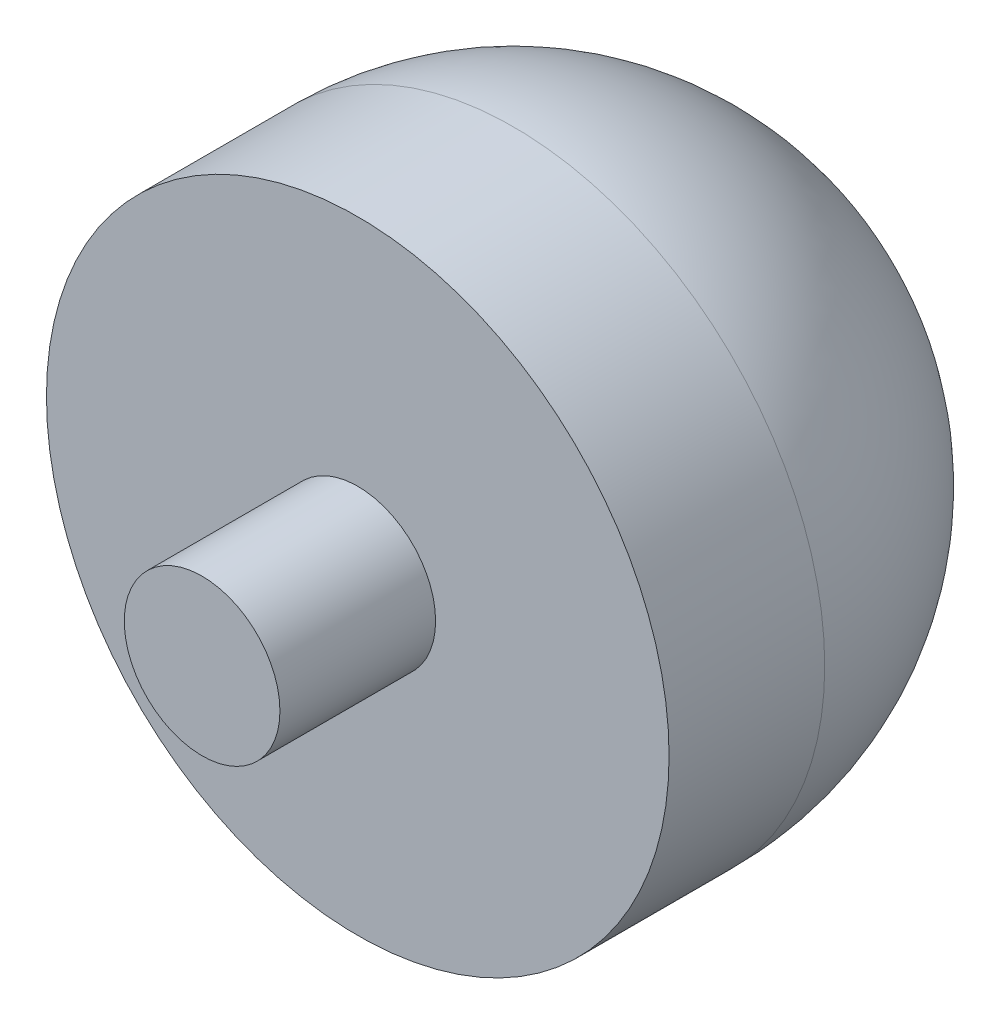
ISO-10303-21;
HEADER;
FILE_DESCRIPTION(('STEP AP214'),'2;1');
FILE_NAME('part.step','',(''),(''),'','','');
FILE_SCHEMA(('AUTOMOTIVE_DESIGN { 1 0 10303 214 1 1 1 1 }'));
ENDSEC;
DATA;
#1=APPLICATION_CONTEXT('core data for automotive mechanical design processes');
#2=APPLICATION_PROTOCOL_DEFINITION('international standard','automotive_design',2000,#1);
#3=PRODUCT_CONTEXT('',#1,'mechanical');
#4=PRODUCT('Part','Part','',(#3));
#5=PRODUCT_RELATED_PRODUCT_CATEGORY('part','',(#4));
#6=PRODUCT_DEFINITION_FORMATION('','',#4);
#7=PRODUCT_DEFINITION_CONTEXT('part definition',#1,'design');
#8=PRODUCT_DEFINITION('design','',#6,#7);
#9=PRODUCT_DEFINITION_SHAPE('','',#8);
#10=(LENGTH_UNIT() NAMED_UNIT(*) SI_UNIT(.MILLI.,.METRE.));
#11=(NAMED_UNIT(*) PLANE_ANGLE_UNIT() SI_UNIT($,.RADIAN.));
#12=(NAMED_UNIT(*) SI_UNIT($,.STERADIAN.) SOLID_ANGLE_UNIT());
#13=UNCERTAINTY_MEASURE_WITH_UNIT(LENGTH_MEASURE(1.E-05),#10,'distance_accuracy_value','');
#14=(GEOMETRIC_REPRESENTATION_CONTEXT(3) GLOBAL_UNCERTAINTY_ASSIGNED_CONTEXT((#13)) GLOBAL_UNIT_ASSIGNED_CONTEXT((#10,
#11,#12)) REPRESENTATION_CONTEXT('',''));
#15=CARTESIAN_POINT('',(0.,0.,0.));
#16=DIRECTION('',(0.,0.,1.));
#17=DIRECTION('',(1.,0.,0.));
#18=AXIS2_PLACEMENT_3D('',#15,#16,#17);
#19=CARTESIAN_POINT('',(0.,0.,30.));
#20=DIRECTION('',(0.,0.,-1.));
#21=DIRECTION('',(-1.,0.,0.));
#22=AXIS2_PLACEMENT_3D('',#19,#20,#21);
#23=CYLINDRICAL_SURFACE('',#22,20.);
#24=CARTESIAN_POINT('',(0.,0.,20.));
#25=DIRECTION('',(0.,0.,-1.));
#26=DIRECTION('',(-1.,0.,0.));
#27=AXIS2_PLACEMENT_3D('',#24,#25,#26);
#28=CIRCLE('',#27,20.);
#29=CARTESIAN_POINT('',(-20.,0.,20.));
#30=VERTEX_POINT('',#29);
#31=EDGE_CURVE('E10',#30,#30,#28,.F.);
#32=ORIENTED_EDGE('',*,*,#31,.T.);
#33=EDGE_LOOP('',(#32));
#34=FACE_BOUND('',#33,.T.);
#35=CARTESIAN_POINT('',(0.,0.,30.));
#36=DIRECTION('',(0.,0.,1.));
#37=DIRECTION('',(1.,0.,0.));
#38=AXIS2_PLACEMENT_3D('',#35,#36,#37);
#39=CIRCLE('',#38,20.);
#40=CARTESIAN_POINT('',(20.,0.,30.));
#41=VERTEX_POINT('',#40);
#42=EDGE_CURVE('E38',#41,#41,#39,.T.);
#43=ORIENTED_EDGE('',*,*,#42,.F.);
#44=EDGE_LOOP('',(#43));
#45=FACE_BOUND('',#44,.T.);
#46=ADVANCED_FACE('F31',(#34,#45),#23,.T.);
#47=CARTESIAN_POINT('',(0.,0.,30.));
#48=DIRECTION('',(0.,0.,1.));
#49=DIRECTION('',(1.,0.,0.));
#50=AXIS2_PLACEMENT_3D('',#47,#48,#49);
#51=PLANE('',#50);
#52=CARTESIAN_POINT('',(0.,0.,30.));
#53=DIRECTION('',(0.,0.,1.));
#54=DIRECTION('',(1.,0.,0.));
#55=AXIS2_PLACEMENT_3D('',#52,#53,#54);
#56=CIRCLE('',#55,5.);
#57=CARTESIAN_POINT('',(5.,0.,30.));
#58=VERTEX_POINT('',#57);
#59=EDGE_CURVE('E46',#58,#58,#56,.T.);
#60=ORIENTED_EDGE('',*,*,#59,.F.);
#61=EDGE_LOOP('',(#60));
#62=FACE_BOUND('',#61,.T.);
#63=ORIENTED_EDGE('',*,*,#42,.T.);
#64=EDGE_LOOP('',(#63));
#65=FACE_BOUND('',#64,.T.);
#66=ADVANCED_FACE('F54',(#62,#65),#51,.T.);
#67=CARTESIAN_POINT('',(0.,0.,40.));
#68=DIRECTION('',(0.,0.,-1.));
#69=DIRECTION('',(-1.,0.,0.));
#70=AXIS2_PLACEMENT_3D('',#67,#68,#69);
#71=CYLINDRICAL_SURFACE('',#70,5.);
#72=CARTESIAN_POINT('',(0.,0.,40.));
#73=DIRECTION('',(0.,0.,1.));
#74=DIRECTION('',(1.,0.,0.));
#75=AXIS2_PLACEMENT_3D('',#72,#73,#74);
#76=CIRCLE('',#75,5.);
#77=CARTESIAN_POINT('',(5.,0.,40.));
#78=VERTEX_POINT('',#77);
#79=EDGE_CURVE('E42',#78,#78,#76,.T.);
#80=ORIENTED_EDGE('',*,*,#79,.F.);
#81=EDGE_LOOP('',(#80));
#82=FACE_BOUND('',#81,.T.);
#83=ORIENTED_EDGE('',*,*,#59,.T.);
#84=EDGE_LOOP('',(#83));
#85=FACE_BOUND('',#84,.T.);
#86=ADVANCED_FACE('F52',(#82,#85),#71,.T.);
#87=CARTESIAN_POINT('',(0.,0.,40.));
#88=DIRECTION('',(0.,0.,1.));
#89=DIRECTION('',(1.,0.,0.));
#90=AXIS2_PLACEMENT_3D('',#87,#88,#89);
#91=PLANE('',#90);
#92=ORIENTED_EDGE('',*,*,#79,.T.);
#93=EDGE_LOOP('',(#92));
#94=FACE_BOUND('',#93,.T.);
#95=ADVANCED_FACE('F61',(#94),#91,.T.);
#96=CARTESIAN_POINT('',(0.,0.,20.));
#97=DIRECTION('',(0.,0.,1.));
#98=DIRECTION('',(1.,0.,0.));
#99=AXIS2_PLACEMENT_3D('',#96,#97,#98);
#100=SPHERICAL_SURFACE('',#99,20.);
#101=ORIENTED_EDGE('',*,*,#31,.F.);
#102=EDGE_LOOP('',(#101));
#103=FACE_BOUND('',#102,.T.);
#104=ADVANCED_FACE('F33',(#103),#100,.T.);
#105=CLOSED_SHELL('',(#46,#66,#86,#95,#104));
#106=MANIFOLD_SOLID_BREP('B2',#105);
#107=ADVANCED_BREP_SHAPE_REPRESENTATION('',(#18,#106),#14);
#108=SHAPE_DEFINITION_REPRESENTATION(#9,#107);
ENDSEC;
END-ISO-10303-21;
